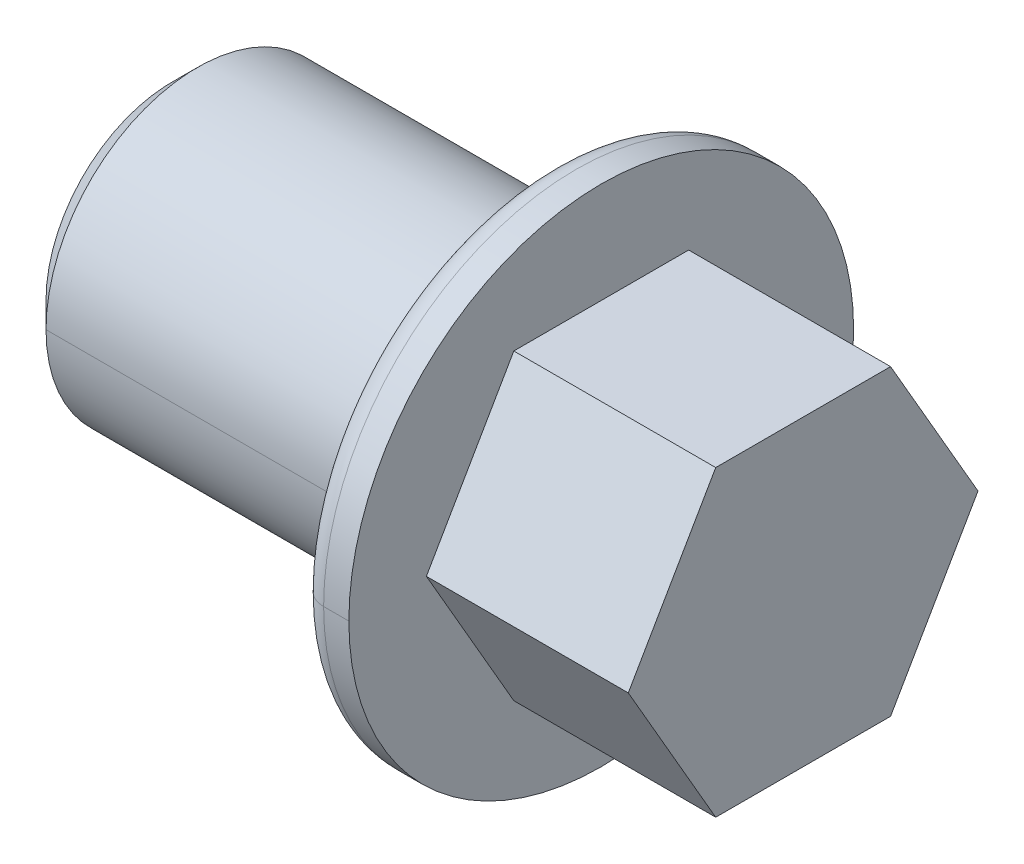
ISO-10303-21;
HEADER;
FILE_DESCRIPTION(('STEP AP214'),'2;1');
FILE_NAME('part.step','',(''),(''),'','','');
FILE_SCHEMA(('AUTOMOTIVE_DESIGN { 1 0 10303 214 1 1 1 1 }'));
ENDSEC;
DATA;
#1=APPLICATION_CONTEXT('core data for automotive mechanical design processes');
#2=APPLICATION_PROTOCOL_DEFINITION('international standard','automotive_design',2000,#1);
#3=PRODUCT_CONTEXT('',#1,'mechanical');
#4=PRODUCT('Part','Part','',(#3));
#5=PRODUCT_RELATED_PRODUCT_CATEGORY('part','',(#4));
#6=PRODUCT_DEFINITION_FORMATION('','',#4);
#7=PRODUCT_DEFINITION_CONTEXT('part definition',#1,'design');
#8=PRODUCT_DEFINITION('design','',#6,#7);
#9=PRODUCT_DEFINITION_SHAPE('','',#8);
#10=(LENGTH_UNIT() NAMED_UNIT(*) SI_UNIT(.MILLI.,.METRE.));
#11=(NAMED_UNIT(*) PLANE_ANGLE_UNIT() SI_UNIT($,.RADIAN.));
#12=(NAMED_UNIT(*) SI_UNIT($,.STERADIAN.) SOLID_ANGLE_UNIT());
#13=UNCERTAINTY_MEASURE_WITH_UNIT(LENGTH_MEASURE(1.E-05),#10,'distance_accuracy_value','');
#14=(GEOMETRIC_REPRESENTATION_CONTEXT(3) GLOBAL_UNCERTAINTY_ASSIGNED_CONTEXT((#13)) GLOBAL_UNIT_ASSIGNED_CONTEXT((#10,
#11,#12)) REPRESENTATION_CONTEXT('',''));
#15=CARTESIAN_POINT('',(0.,0.,0.));
#16=DIRECTION('',(0.,0.,1.));
#17=DIRECTION('',(1.,0.,0.));
#18=AXIS2_PLACEMENT_3D('',#15,#16,#17);
#19=CARTESIAN_POINT('',(119.272398751943,-122.5,-62.));
#20=DIRECTION('',(-1.,0.,0.));
#21=DIRECTION('',(0.,0.,1.));
#22=AXIS2_PLACEMENT_3D('',#19,#20,#21);
#23=PLANE('',#22);
#24=CARTESIAN_POINT('',(119.272398751943,-122.5,-62.));
#25=DIRECTION('',(-1.,0.,0.));
#26=DIRECTION('',(0.,0.,1.));
#27=AXIS2_PLACEMENT_3D('',#24,#25,#26);
#28=CIRCLE('',#27,6.);
#29=CARTESIAN_POINT('',(119.272398751943,-122.5,-56.));
#30=VERTEX_POINT('',#29);
#31=CARTESIAN_POINT('',(119.272398751943,-122.5,-68.));
#32=VERTEX_POINT('',#31);
#33=EDGE_CURVE('E137',#30,#32,#28,.T.);
#34=ORIENTED_EDGE('',*,*,#33,.F.);
#35=CARTESIAN_POINT('',(119.272398751943,-122.5,-62.));
#36=DIRECTION('',(-1.,0.,0.));
#37=DIRECTION('',(0.,0.,1.));
#38=AXIS2_PLACEMENT_3D('',#35,#36,#37);
#39=CIRCLE('',#38,6.);
#40=EDGE_CURVE('E36',#32,#30,#39,.T.);
#41=ORIENTED_EDGE('',*,*,#40,.F.);
#42=EDGE_LOOP('',(#34,#41));
#43=FACE_BOUND('',#42,.T.);
#44=CARTESIAN_POINT('',(119.272398751943,-122.5,-62.));
#45=DIRECTION('',(-1.,0.,0.));
#46=DIRECTION('',(0.,0.,1.));
#47=AXIS2_PLACEMENT_3D('',#44,#45,#46);
#48=CIRCLE('',#47,5.);
#49=CARTESIAN_POINT('',(119.272398751943,-122.5,-57.));
#50=VERTEX_POINT('',#49);
#51=CARTESIAN_POINT('',(119.272398751943,-122.5,-67.));
#52=VERTEX_POINT('',#51);
#53=EDGE_CURVE('E11',#50,#52,#48,.T.);
#54=ORIENTED_EDGE('',*,*,#53,.T.);
#55=CARTESIAN_POINT('',(119.272398751943,-122.5,-62.));
#56=DIRECTION('',(-1.,0.,0.));
#57=DIRECTION('',(0.,0.,1.));
#58=AXIS2_PLACEMENT_3D('',#55,#56,#57);
#59=CIRCLE('',#58,5.);
#60=EDGE_CURVE('E27',#52,#50,#59,.T.);
#61=ORIENTED_EDGE('',*,*,#60,.T.);
#62=EDGE_LOOP('',(#54,#61));
#63=FACE_BOUND('',#62,.T.);
#64=ADVANCED_FACE('F17',(#43,#63),#23,.F.);
#65=CARTESIAN_POINT('',(120.272398751943,-122.5,-62.));
#66=DIRECTION('',(-1.,0.,0.));
#67=DIRECTION('',(0.,0.,-1.));
#68=AXIS2_PLACEMENT_3D('',#65,#66,#67);
#69=CYLINDRICAL_SURFACE('',#68,5.);
#70=DIRECTION('',(1.,0.,0.));
#71=VECTOR('',#70,1.);
#72=CARTESIAN_POINT('',(120.272398751943,-122.5,-67.));
#73=LINE('',#72,#71);
#74=CARTESIAN_POINT('',(121.272398751943,-122.5,-67.));
#75=VERTEX_POINT('',#74);
#76=EDGE_CURVE('E156',#52,#75,#73,.T.);
#77=ORIENTED_EDGE('',*,*,#76,.T.);
#78=CARTESIAN_POINT('',(121.272398751943,-122.5,-62.));
#79=DIRECTION('',(-1.,0.,0.));
#80=DIRECTION('',(0.,0.,1.));
#81=AXIS2_PLACEMENT_3D('',#78,#79,#80);
#82=CIRCLE('',#81,5.);
#83=CARTESIAN_POINT('',(121.272398751943,-122.5,-57.));
#84=VERTEX_POINT('',#83);
#85=EDGE_CURVE('E159',#75,#84,#82,.T.);
#86=ORIENTED_EDGE('',*,*,#85,.T.);
#87=DIRECTION('',(1.,0.,0.));
#88=VECTOR('',#87,1.);
#89=CARTESIAN_POINT('',(120.272398751943,-122.5,-57.));
#90=LINE('',#89,#88);
#91=EDGE_CURVE('E162',#50,#84,#90,.T.);
#92=ORIENTED_EDGE('',*,*,#91,.F.);
#93=ORIENTED_EDGE('',*,*,#60,.F.);
#94=EDGE_LOOP('',(#77,#86,#92,#93));
#95=FACE_BOUND('',#94,.T.);
#96=ADVANCED_FACE('F294',(#95),#69,.T.);
#97=CARTESIAN_POINT('',(120.272398751943,-122.5,-62.));
#98=DIRECTION('',(-1.,0.,0.));
#99=DIRECTION('',(0.,0.,-1.));
#100=AXIS2_PLACEMENT_3D('',#97,#98,#99);
#101=CYLINDRICAL_SURFACE('',#100,5.);
#102=ORIENTED_EDGE('',*,*,#91,.T.);
#103=CARTESIAN_POINT('',(121.272398751943,-122.5,-62.));
#104=DIRECTION('',(-1.,0.,0.));
#105=DIRECTION('',(0.,0.,1.));
#106=AXIS2_PLACEMENT_3D('',#103,#104,#105);
#107=CIRCLE('',#106,5.);
#108=EDGE_CURVE('E164',#84,#75,#107,.T.);
#109=ORIENTED_EDGE('',*,*,#108,.T.);
#110=ORIENTED_EDGE('',*,*,#76,.F.);
#111=ORIENTED_EDGE('',*,*,#53,.F.);
#112=EDGE_LOOP('',(#102,#109,#110,#111));
#113=FACE_BOUND('',#112,.T.);
#114=ADVANCED_FACE('F256',(#113),#101,.T.);
#115=CARTESIAN_POINT('',(123.272398751943,-122.5,-62.));
#116=DIRECTION('',(1.,0.,0.));
#117=DIRECTION('',(0.,0.,1.));
#118=AXIS2_PLACEMENT_3D('',#115,#116,#117);
#119=PLANE('',#118);
#120=CARTESIAN_POINT('',(123.272398751943,-122.5,-62.));
#121=DIRECTION('',(-1.,0.,0.));
#122=DIRECTION('',(0.,0.,-1.));
#123=AXIS2_PLACEMENT_3D('',#120,#121,#122);
#124=CIRCLE('',#123,10.);
#125=CARTESIAN_POINT('',(123.272398751943,-122.5,-52.));
#126=VERTEX_POINT('',#125);
#127=CARTESIAN_POINT('',(123.272398751943,-122.5,-72.));
#128=VERTEX_POINT('',#127);
#129=EDGE_CURVE('E168',#126,#128,#124,.T.);
#130=ORIENTED_EDGE('',*,*,#129,.F.);
#131=CARTESIAN_POINT('',(123.272398751943,-122.5,-62.));
#132=DIRECTION('',(-1.,0.,0.));
#133=DIRECTION('',(0.,0.,-1.));
#134=AXIS2_PLACEMENT_3D('',#131,#132,#133);
#135=CIRCLE('',#134,10.);
#136=EDGE_CURVE('E172',#128,#126,#135,.T.);
#137=ORIENTED_EDGE('',*,*,#136,.F.);
#138=EDGE_LOOP('',(#130,#137));
#139=FACE_BOUND('',#138,.T.);
#140=DIRECTION('',(0.,-0.866025403784329,0.50000000000019));
#141=VECTOR('',#140,1.);
#142=CARTESIAN_POINT('',(123.272398751943,-119.5,-56.80384757729));
#143=LINE('',#142,#141);
#144=CARTESIAN_POINT('',(123.272398751943,-116.5,-58.53589838486));
#145=VERTEX_POINT('',#144);
#146=CARTESIAN_POINT('',(123.272398751943,-122.5,-55.07179676972));
#147=VERTEX_POINT('',#146);
#148=EDGE_CURVE('E167',#145,#147,#143,.T.);
#149=ORIENTED_EDGE('',*,*,#148,.F.);
#150=DIRECTION('',(0.,0.,1.));
#151=VECTOR('',#150,1.);
#152=CARTESIAN_POINT('',(123.272398751943,-116.5,-62.));
#153=LINE('',#152,#151);
#154=CARTESIAN_POINT('',(123.272398751943,-116.5,-65.46410161514));
#155=VERTEX_POINT('',#154);
#156=EDGE_CURVE('E179',#155,#145,#153,.T.);
#157=ORIENTED_EDGE('',*,*,#156,.F.);
#158=DIRECTION('',(0.,0.866025403784329,0.50000000000019));
#159=VECTOR('',#158,1.);
#160=CARTESIAN_POINT('',(123.272398751943,-119.5,-67.19615242271));
#161=LINE('',#160,#159);
#162=CARTESIAN_POINT('',(123.272398751943,-122.5,-68.92820323028));
#163=VERTEX_POINT('',#162);
#164=EDGE_CURVE('E182',#163,#155,#161,.T.);
#165=ORIENTED_EDGE('',*,*,#164,.F.);
#166=DIRECTION('',(0.,0.866025403784329,-0.50000000000019));
#167=VECTOR('',#166,1.);
#168=CARTESIAN_POINT('',(123.272398751943,-125.5,-67.19615242271));
#169=LINE('',#168,#167);
#170=CARTESIAN_POINT('',(123.272398751943,-128.5,-65.46410161514));
#171=VERTEX_POINT('',#170);
#172=EDGE_CURVE('E185',#171,#163,#169,.T.);
#173=ORIENTED_EDGE('',*,*,#172,.F.);
#174=DIRECTION('',(0.,0.,-1.));
#175=VECTOR('',#174,1.);
#176=CARTESIAN_POINT('',(123.272398751943,-128.5,-62.));
#177=LINE('',#176,#175);
#178=CARTESIAN_POINT('',(123.272398751943,-128.5,-58.53589838486));
#179=VERTEX_POINT('',#178);
#180=EDGE_CURVE('E188',#179,#171,#177,.T.);
#181=ORIENTED_EDGE('',*,*,#180,.F.);
#182=DIRECTION('',(0.,-0.866025403784329,-0.50000000000019));
#183=VECTOR('',#182,1.);
#184=CARTESIAN_POINT('',(123.272398751943,-125.5,-56.80384757729));
#185=LINE('',#184,#183);
#186=EDGE_CURVE('E191',#147,#179,#185,.T.);
#187=ORIENTED_EDGE('',*,*,#186,.F.);
#188=EDGE_LOOP('',(#149,#157,#165,#173,#181,#187));
#189=FACE_BOUND('',#188,.T.);
#190=ADVANCED_FACE('F252',(#139,#189),#119,.T.);
#191=CARTESIAN_POINT('',(131.272398751943,-116.5,-58.53589838486));
#192=DIRECTION('',(0.,-0.50000000000019,-0.866025403784329));
#193=DIRECTION('',(0.,0.866025403784329,-0.50000000000019));
#194=AXIS2_PLACEMENT_3D('',#191,#192,#193);
#195=PLANE('',#194);
#196=ORIENTED_EDGE('',*,*,#148,.T.);
#197=DIRECTION('',(-1.,0.,0.));
#198=VECTOR('',#197,1.);
#199=CARTESIAN_POINT('',(127.272398751943,-122.5,-55.07179676972));
#200=LINE('',#199,#198);
#201=CARTESIAN_POINT('',(131.272398751943,-122.5,-55.07179676972));
#202=VERTEX_POINT('',#201);
#203=EDGE_CURVE('E193',#202,#147,#200,.T.);
#204=ORIENTED_EDGE('',*,*,#203,.F.);
#205=DIRECTION('',(0.,-0.866025403784329,0.50000000000019));
#206=VECTOR('',#205,1.);
#207=CARTESIAN_POINT('',(131.272398751943,-119.5,-56.80384757729));
#208=LINE('',#207,#206);
#209=CARTESIAN_POINT('',(131.272398751943,-116.5,-58.53589838486));
#210=VERTEX_POINT('',#209);
#211=EDGE_CURVE('E197',#210,#202,#208,.T.);
#212=ORIENTED_EDGE('',*,*,#211,.F.);
#213=DIRECTION('',(-1.,0.,0.));
#214=VECTOR('',#213,1.);
#215=CARTESIAN_POINT('',(127.272398751943,-116.5,-58.53589838486));
#216=LINE('',#215,#214);
#217=EDGE_CURVE('E178',#210,#145,#216,.T.);
#218=ORIENTED_EDGE('',*,*,#217,.T.);
#219=EDGE_LOOP('',(#196,#204,#212,#218));
#220=FACE_BOUND('',#219,.T.);
#221=ADVANCED_FACE('F255',(#220),#195,.F.);
#222=CARTESIAN_POINT('',(131.272398751943,-116.5,-65.46410161514));
#223=DIRECTION('',(0.,-1.,0.));
#224=DIRECTION('',(0.,0.,-1.));
#225=AXIS2_PLACEMENT_3D('',#222,#223,#224);
#226=PLANE('',#225);
#227=ORIENTED_EDGE('',*,*,#156,.T.);
#228=ORIENTED_EDGE('',*,*,#217,.F.);
#229=DIRECTION('',(0.,0.,1.));
#230=VECTOR('',#229,1.);
#231=CARTESIAN_POINT('',(131.272398751943,-116.5,-62.));
#232=LINE('',#231,#230);
#233=CARTESIAN_POINT('',(131.272398751943,-116.5,-65.46410161514));
#234=VERTEX_POINT('',#233);
#235=EDGE_CURVE('E199',#234,#210,#232,.T.);
#236=ORIENTED_EDGE('',*,*,#235,.F.);
#237=DIRECTION('',(-1.,0.,0.));
#238=VECTOR('',#237,1.);
#239=CARTESIAN_POINT('',(127.272398751943,-116.5,-65.46410161514));
#240=LINE('',#239,#238);
#241=EDGE_CURVE('E181',#234,#155,#240,.T.);
#242=ORIENTED_EDGE('',*,*,#241,.T.);
#243=EDGE_LOOP('',(#227,#228,#236,#242));
#244=FACE_BOUND('',#243,.T.);
#245=ADVANCED_FACE('F266',(#244),#226,.F.);
#246=CARTESIAN_POINT('',(131.272398751943,-122.5,-68.92820323028));
#247=DIRECTION('',(0.,-0.50000000000019,0.866025403784329));
#248=DIRECTION('',(0.,-0.866025403784329,-0.50000000000019));
#249=AXIS2_PLACEMENT_3D('',#246,#247,#248);
#250=PLANE('',#249);
#251=ORIENTED_EDGE('',*,*,#164,.T.);
#252=ORIENTED_EDGE('',*,*,#241,.F.);
#253=DIRECTION('',(0.,0.866025403784329,0.50000000000019));
#254=VECTOR('',#253,1.);
#255=CARTESIAN_POINT('',(131.272398751943,-119.5,-67.19615242271));
#256=LINE('',#255,#254);
#257=CARTESIAN_POINT('',(131.272398751943,-122.5,-68.92820323028));
#258=VERTEX_POINT('',#257);
#259=EDGE_CURVE('E205',#258,#234,#256,.T.);
#260=ORIENTED_EDGE('',*,*,#259,.F.);
#261=DIRECTION('',(-1.,0.,0.));
#262=VECTOR('',#261,1.);
#263=CARTESIAN_POINT('',(127.272398751943,-122.5,-68.92820323028));
#264=LINE('',#263,#262);
#265=EDGE_CURVE('E184',#258,#163,#264,.T.);
#266=ORIENTED_EDGE('',*,*,#265,.T.);
#267=EDGE_LOOP('',(#251,#252,#260,#266));
#268=FACE_BOUND('',#267,.T.);
#269=ADVANCED_FACE('F272',(#268),#250,.F.);
#270=CARTESIAN_POINT('',(131.272398751943,-128.5,-65.46410161514));
#271=DIRECTION('',(0.,0.50000000000019,0.866025403784329));
#272=DIRECTION('',(0.,-0.866025403784329,0.50000000000019));
#273=AXIS2_PLACEMENT_3D('',#270,#271,#272);
#274=PLANE('',#273);
#275=ORIENTED_EDGE('',*,*,#172,.T.);
#276=ORIENTED_EDGE('',*,*,#265,.F.);
#277=DIRECTION('',(0.,0.866025403784329,-0.50000000000019));
#278=VECTOR('',#277,1.);
#279=CARTESIAN_POINT('',(131.272398751943,-125.5,-67.19615242271));
#280=LINE('',#279,#278);
#281=CARTESIAN_POINT('',(131.272398751943,-128.5,-65.46410161514));
#282=VERTEX_POINT('',#281);
#283=EDGE_CURVE('E210',#282,#258,#280,.T.);
#284=ORIENTED_EDGE('',*,*,#283,.F.);
#285=DIRECTION('',(-1.,0.,0.));
#286=VECTOR('',#285,1.);
#287=CARTESIAN_POINT('',(127.272398751943,-128.5,-65.46410161514));
#288=LINE('',#287,#286);
#289=EDGE_CURVE('E187',#282,#171,#288,.T.);
#290=ORIENTED_EDGE('',*,*,#289,.T.);
#291=EDGE_LOOP('',(#275,#276,#284,#290));
#292=FACE_BOUND('',#291,.T.);
#293=ADVANCED_FACE('F274',(#292),#274,.F.);
#294=CARTESIAN_POINT('',(131.272398751943,-128.5,-58.53589838486));
#295=DIRECTION('',(0.,1.,0.));
#296=DIRECTION('',(0.,0.,1.));
#297=AXIS2_PLACEMENT_3D('',#294,#295,#296);
#298=PLANE('',#297);
#299=ORIENTED_EDGE('',*,*,#180,.T.);
#300=ORIENTED_EDGE('',*,*,#289,.F.);
#301=DIRECTION('',(0.,0.,-1.));
#302=VECTOR('',#301,1.);
#303=CARTESIAN_POINT('',(131.272398751943,-128.5,-62.));
#304=LINE('',#303,#302);
#305=CARTESIAN_POINT('',(131.272398751943,-128.5,-58.53589838486));
#306=VERTEX_POINT('',#305);
#307=EDGE_CURVE('E196',#306,#282,#304,.T.);
#308=ORIENTED_EDGE('',*,*,#307,.F.);
#309=DIRECTION('',(-1.,0.,0.));
#310=VECTOR('',#309,1.);
#311=CARTESIAN_POINT('',(127.272398751943,-128.5,-58.53589838486));
#312=LINE('',#311,#310);
#313=EDGE_CURVE('E190',#306,#179,#312,.T.);
#314=ORIENTED_EDGE('',*,*,#313,.T.);
#315=EDGE_LOOP('',(#299,#300,#308,#314));
#316=FACE_BOUND('',#315,.T.);
#317=ADVANCED_FACE('F279',(#316),#298,.F.);
#318=CARTESIAN_POINT('',(131.272398751943,-122.5,-55.07179676972));
#319=DIRECTION('',(0.,0.50000000000019,-0.866025403784329));
#320=DIRECTION('',(0.,0.866025403784329,0.50000000000019));
#321=AXIS2_PLACEMENT_3D('',#318,#319,#320);
#322=PLANE('',#321);
#323=ORIENTED_EDGE('',*,*,#186,.T.);
#324=ORIENTED_EDGE('',*,*,#313,.F.);
#325=DIRECTION('',(0.,-0.866025403784329,-0.50000000000019));
#326=VECTOR('',#325,1.);
#327=CARTESIAN_POINT('',(131.272398751943,-125.5,-56.80384757729));
#328=LINE('',#327,#326);
#329=EDGE_CURVE('E200',#202,#306,#328,.T.);
#330=ORIENTED_EDGE('',*,*,#329,.F.);
#331=ORIENTED_EDGE('',*,*,#203,.T.);
#332=EDGE_LOOP('',(#323,#324,#330,#331));
#333=FACE_BOUND('',#332,.T.);
#334=ADVANCED_FACE('F282',(#333),#322,.F.);
#335=CARTESIAN_POINT('',(131.272398751943,-122.5,-62.));
#336=DIRECTION('',(1.,0.,0.));
#337=DIRECTION('',(0.,0.,1.));
#338=AXIS2_PLACEMENT_3D('',#335,#336,#337);
#339=PLANE('',#338);
#340=ORIENTED_EDGE('',*,*,#307,.T.);
#341=ORIENTED_EDGE('',*,*,#283,.T.);
#342=ORIENTED_EDGE('',*,*,#259,.T.);
#343=ORIENTED_EDGE('',*,*,#235,.T.);
#344=ORIENTED_EDGE('',*,*,#211,.T.);
#345=ORIENTED_EDGE('',*,*,#329,.T.);
#346=EDGE_LOOP('',(#340,#341,#342,#343,#344,#345));
#347=FACE_BOUND('',#346,.T.);
#348=ADVANCED_FACE('F269',(#347),#339,.T.);
#349=CARTESIAN_POINT('',(121.272398751943,-122.5,-62.));
#350=DIRECTION('',(-1.,0.,0.));
#351=DIRECTION('',(0.,0.,-1.));
#352=AXIS2_PLACEMENT_3D('',#349,#350,#351);
#353=PLANE('',#352);
#354=CARTESIAN_POINT('',(121.272398751943,-122.5,-62.));
#355=DIRECTION('',(-1.,0.,0.));
#356=DIRECTION('',(0.,0.,1.));
#357=AXIS2_PLACEMENT_3D('',#354,#355,#356);
#358=CIRCLE('',#357,9.);
#359=CARTESIAN_POINT('',(121.272398751943,-122.5,-71.));
#360=VERTEX_POINT('',#359);
#361=CARTESIAN_POINT('',(121.272398751943,-122.499999533447,-53.));
#362=VERTEX_POINT('',#361);
#363=EDGE_CURVE('E223',#360,#362,#358,.T.);
#364=ORIENTED_EDGE('',*,*,#363,.T.);
#365=CARTESIAN_POINT('',(121.272398751943,-122.5,-62.));
#366=DIRECTION('',(-1.,0.,0.));
#367=DIRECTION('',(0.,0.,1.));
#368=AXIS2_PLACEMENT_3D('',#365,#366,#367);
#369=CIRCLE('',#368,9.);
#370=EDGE_CURVE('E226',#362,#360,#369,.T.);
#371=ORIENTED_EDGE('',*,*,#370,.T.);
#372=EDGE_LOOP('',(#364,#371));
#373=FACE_BOUND('',#372,.T.);
#374=ORIENTED_EDGE('',*,*,#85,.F.);
#375=ORIENTED_EDGE('',*,*,#108,.F.);
#376=EDGE_LOOP('',(#374,#375));
#377=FACE_BOUND('',#376,.T.);
#378=ADVANCED_FACE('F290',(#373,#377),#353,.T.);
#379=CARTESIAN_POINT('',(122.272398751943,-122.5,-62.));
#380=DIRECTION('',(-1.,0.,0.));
#381=DIRECTION('',(0.,0.,-1.));
#382=AXIS2_PLACEMENT_3D('',#379,#380,#381);
#383=CYLINDRICAL_SURFACE('',#382,10.);
#384=DIRECTION('',(1.,0.,0.));
#385=VECTOR('',#384,1.);
#386=CARTESIAN_POINT('',(122.272398751943,-122.5,-72.));
#387=LINE('',#386,#385);
#388=CARTESIAN_POINT('',(122.272398751943,-122.5,-72.));
#389=VERTEX_POINT('',#388);
#390=EDGE_CURVE('E175',#389,#128,#387,.T.);
#391=ORIENTED_EDGE('',*,*,#390,.T.);
#392=ORIENTED_EDGE('',*,*,#136,.T.);
#393=DIRECTION('',(1.,0.,0.));
#394=VECTOR('',#393,1.);
#395=CARTESIAN_POINT('',(122.272398751943,-122.5,-52.));
#396=LINE('',#395,#394);
#397=CARTESIAN_POINT('',(122.272398751943,-122.5,-52.));
#398=VERTEX_POINT('',#397);
#399=EDGE_CURVE('E170',#398,#126,#396,.T.);
#400=ORIENTED_EDGE('',*,*,#399,.F.);
#401=CARTESIAN_POINT('',(122.272398751943,-122.5,-62.));
#402=DIRECTION('',(-1.,0.,0.));
#403=DIRECTION('',(0.,0.,1.));
#404=AXIS2_PLACEMENT_3D('',#401,#402,#403);
#405=CIRCLE('',#404,10.);
#406=EDGE_CURVE('E232',#389,#398,#405,.T.);
#407=ORIENTED_EDGE('',*,*,#406,.F.);
#408=EDGE_LOOP('',(#391,#392,#400,#407));
#409=FACE_BOUND('',#408,.T.);
#410=ADVANCED_FACE('F248',(#409),#383,.T.);
#411=CARTESIAN_POINT('',(122.272398751943,-122.5,-62.));
#412=DIRECTION('',(-1.,0.,0.));
#413=DIRECTION('',(0.,0.,-1.));
#414=AXIS2_PLACEMENT_3D('',#411,#412,#413);
#415=CYLINDRICAL_SURFACE('',#414,10.);
#416=ORIENTED_EDGE('',*,*,#399,.T.);
#417=ORIENTED_EDGE('',*,*,#129,.T.);
#418=ORIENTED_EDGE('',*,*,#390,.F.);
#419=CARTESIAN_POINT('',(122.272398751943,-122.5,-62.));
#420=DIRECTION('',(-1.,0.,0.));
#421=DIRECTION('',(0.,0.,1.));
#422=AXIS2_PLACEMENT_3D('',#419,#420,#421);
#423=CIRCLE('',#422,10.);
#424=EDGE_CURVE('E145',#398,#389,#423,.T.);
#425=ORIENTED_EDGE('',*,*,#424,.F.);
#426=EDGE_LOOP('',(#416,#417,#418,#425));
#427=FACE_BOUND('',#426,.T.);
#428=ADVANCED_FACE('F249',(#427),#415,.T.);
#429=CARTESIAN_POINT('',(122.272398751943,-122.5,-62.));
#430=DIRECTION('',(-1.,0.,0.));
#431=DIRECTION('',(0.,0.,1.));
#432=AXIS2_PLACEMENT_3D('',#429,#430,#431);
#433=TOROIDAL_SURFACE('',#432,9.,1.);
#434=CARTESIAN_POINT('',(122.272398751943,-122.5,-71.));
#435=DIRECTION('',(0.,-1.,0.));
#436=DIRECTION('',(0.,0.,-1.));
#437=AXIS2_PLACEMENT_3D('',#434,#435,#436);
#438=CIRCLE('',#437,1.);
#439=EDGE_CURVE('E171',#360,#389,#438,.T.);
#440=ORIENTED_EDGE('',*,*,#439,.T.);
#441=ORIENTED_EDGE('',*,*,#406,.T.);
#442=CARTESIAN_POINT('',(122.272398751943,-122.5,-53.));
#443=DIRECTION('',(0.,1.,0.));
#444=DIRECTION('',(0.,0.,-1.));
#445=AXIS2_PLACEMENT_3D('',#442,#443,#444);
#446=CIRCLE('',#445,1.);
#447=EDGE_CURVE('E147',#362,#398,#446,.T.);
#448=ORIENTED_EDGE('',*,*,#447,.F.);
#449=ORIENTED_EDGE('',*,*,#363,.F.);
#450=EDGE_LOOP('',(#440,#441,#448,#449));
#451=FACE_BOUND('',#450,.T.);
#452=ADVANCED_FACE('F238',(#451),#433,.T.);
#453=CARTESIAN_POINT('',(122.272398751943,-122.5,-62.));
#454=DIRECTION('',(-1.,0.,0.));
#455=DIRECTION('',(0.,0.447555956613777,-0.894255928523556));
#456=AXIS2_PLACEMENT_3D('',#453,#454,#455);
#457=TOROIDAL_SURFACE('',#456,9.,1.);
#458=ORIENTED_EDGE('',*,*,#447,.T.);
#459=ORIENTED_EDGE('',*,*,#424,.T.);
#460=ORIENTED_EDGE('',*,*,#439,.F.);
#461=ORIENTED_EDGE('',*,*,#370,.F.);
#462=EDGE_LOOP('',(#458,#459,#460,#461));
#463=FACE_BOUND('',#462,.T.);
#464=ADVANCED_FACE('F244',(#463),#457,.T.);
#465=CARTESIAN_POINT('',(106.272398751943,-122.5,-62.));
#466=DIRECTION('',(-1.,0.,0.));
#467=DIRECTION('',(0.,0.,-1.));
#468=AXIS2_PLACEMENT_3D('',#465,#466,#467);
#469=PLANE('',#468);
#470=CARTESIAN_POINT('',(106.272398751943,-122.5,-62.));
#471=DIRECTION('',(-1.,0.,0.));
#472=DIRECTION('',(0.,0.,1.));
#473=AXIS2_PLACEMENT_3D('',#470,#471,#472);
#474=CIRCLE('',#473,5.);
#475=CARTESIAN_POINT('',(106.272398751943,-122.500000006072,-57.));
#476=VERTEX_POINT('',#475);
#477=CARTESIAN_POINT('',(106.272398751943,-122.5,-67.));
#478=VERTEX_POINT('',#477);
#479=EDGE_CURVE('E142',#476,#478,#474,.T.);
#480=ORIENTED_EDGE('',*,*,#479,.T.);
#481=CARTESIAN_POINT('',(106.272398751943,-122.5,-62.));
#482=DIRECTION('',(-1.,0.,0.));
#483=DIRECTION('',(0.,0.,1.));
#484=AXIS2_PLACEMENT_3D('',#481,#482,#483);
#485=CIRCLE('',#484,5.);
#486=EDGE_CURVE('E139',#478,#476,#485,.T.);
#487=ORIENTED_EDGE('',*,*,#486,.T.);
#488=EDGE_LOOP('',(#480,#487));
#489=FACE_BOUND('',#488,.T.);
#490=ADVANCED_FACE('F144',(#489),#469,.T.);
#491=CARTESIAN_POINT('',(112.772398751943,-122.5,-62.));
#492=DIRECTION('',(-1.,0.,0.));
#493=DIRECTION('',(0.,0.,-1.));
#494=AXIS2_PLACEMENT_3D('',#491,#492,#493);
#495=CYLINDRICAL_SURFACE('',#494,6.);
#496=DIRECTION('',(-1.,0.,0.));
#497=VECTOR('',#496,1.);
#498=CARTESIAN_POINT('',(112.772398751943,-122.5,-56.));
#499=LINE('',#498,#497);
#500=CARTESIAN_POINT('',(107.272398751943,-122.5,-56.));
#501=VERTEX_POINT('',#500);
#502=EDGE_CURVE('E124',#30,#501,#499,.T.);
#503=ORIENTED_EDGE('',*,*,#502,.F.);
#504=ORIENTED_EDGE('',*,*,#33,.T.);
#505=DIRECTION('',(-1.,0.,0.));
#506=VECTOR('',#505,1.);
#507=CARTESIAN_POINT('',(112.772398751943,-122.5,-68.));
#508=LINE('',#507,#506);
#509=CARTESIAN_POINT('',(107.272398751943,-122.5,-68.));
#510=VERTEX_POINT('',#509);
#511=EDGE_CURVE('E122',#32,#510,#508,.T.);
#512=ORIENTED_EDGE('',*,*,#511,.T.);
#513=CARTESIAN_POINT('',(107.272398751943,-122.5,-62.));
#514=DIRECTION('',(-1.,0.,0.));
#515=DIRECTION('',(0.,0.,1.));
#516=AXIS2_PLACEMENT_3D('',#513,#514,#515);
#517=CIRCLE('',#516,6.);
#518=EDGE_CURVE('E130',#501,#510,#517,.T.);
#519=ORIENTED_EDGE('',*,*,#518,.F.);
#520=EDGE_LOOP('',(#503,#504,#512,#519));
#521=FACE_BOUND('',#520,.T.);
#522=ADVANCED_FACE('F136',(#521),#495,.T.);
#523=CARTESIAN_POINT('',(112.772398751943,-122.5,-62.));
#524=DIRECTION('',(-1.,0.,0.));
#525=DIRECTION('',(0.,0.,-1.));
#526=AXIS2_PLACEMENT_3D('',#523,#524,#525);
#527=CYLINDRICAL_SURFACE('',#526,6.);
#528=ORIENTED_EDGE('',*,*,#511,.F.);
#529=ORIENTED_EDGE('',*,*,#40,.T.);
#530=ORIENTED_EDGE('',*,*,#502,.T.);
#531=CARTESIAN_POINT('',(107.272398751943,-122.5,-62.));
#532=DIRECTION('',(-1.,0.,0.));
#533=DIRECTION('',(0.,0.,1.));
#534=AXIS2_PLACEMENT_3D('',#531,#532,#533);
#535=CIRCLE('',#534,6.);
#536=EDGE_CURVE('E117',#510,#501,#535,.T.);
#537=ORIENTED_EDGE('',*,*,#536,.F.);
#538=EDGE_LOOP('',(#528,#529,#530,#537));
#539=FACE_BOUND('',#538,.T.);
#540=ADVANCED_FACE('F120',(#539),#527,.T.);
#541=CARTESIAN_POINT('',(101.272398751943,-122.5,-62.));
#542=DIRECTION('',(1.,0.,0.));
#543=DIRECTION('',(0.,-0.0955812586192965,0.995421630767963));
#544=AXIS2_PLACEMENT_3D('',#541,#542,#543);
#545=CONICAL_SURFACE('',#544,0.,0.785398163396999);
#546=DIRECTION('',(-0.707106781186548,0.,-0.707106781186548));
#547=VECTOR('',#546,1.);
#548=CARTESIAN_POINT('',(106.772398751943,-122.5,-56.5));
#549=LINE('',#548,#547);
#550=EDGE_CURVE('E126',#501,#476,#549,.T.);
#551=ORIENTED_EDGE('',*,*,#550,.F.);
#552=ORIENTED_EDGE('',*,*,#518,.T.);
#553=DIRECTION('',(-0.707106781186548,0.,0.707106781186548));
#554=VECTOR('',#553,1.);
#555=CARTESIAN_POINT('',(106.772398751943,-122.5,-67.5));
#556=LINE('',#555,#554);
#557=EDGE_CURVE('E21',#510,#478,#556,.T.);
#558=ORIENTED_EDGE('',*,*,#557,.T.);
#559=ORIENTED_EDGE('',*,*,#479,.F.);
#560=EDGE_LOOP('',(#551,#552,#558,#559));
#561=FACE_BOUND('',#560,.T.);
#562=ADVANCED_FACE('F131',(#561),#545,.T.);
#563=CARTESIAN_POINT('',(101.272398751943,-122.5,-62.));
#564=DIRECTION('',(1.,0.,0.));
#565=DIRECTION('',(0.,0.,-1.));
#566=AXIS2_PLACEMENT_3D('',#563,#564,#565);
#567=CONICAL_SURFACE('',#566,0.,0.785398163396999);
#568=ORIENTED_EDGE('',*,*,#557,.F.);
#569=ORIENTED_EDGE('',*,*,#536,.T.);
#570=ORIENTED_EDGE('',*,*,#550,.T.);
#571=ORIENTED_EDGE('',*,*,#486,.F.);
#572=EDGE_LOOP('',(#568,#569,#570,#571));
#573=FACE_BOUND('',#572,.T.);
#574=ADVANCED_FACE('F19',(#573),#567,.T.);
#575=CLOSED_SHELL('',(#64,#96,#114,#190,#221,#245,#269,#293,#317,#334,#348,#378,#410,#428,#452,
#464,#490,#522,#540,#562,#574));
#576=MANIFOLD_SOLID_BREP('B1',#575);
#577=ADVANCED_BREP_SHAPE_REPRESENTATION('',(#18,#576),#14);
#578=SHAPE_DEFINITION_REPRESENTATION(#9,#577);
ENDSEC;
END-ISO-10303-21;
